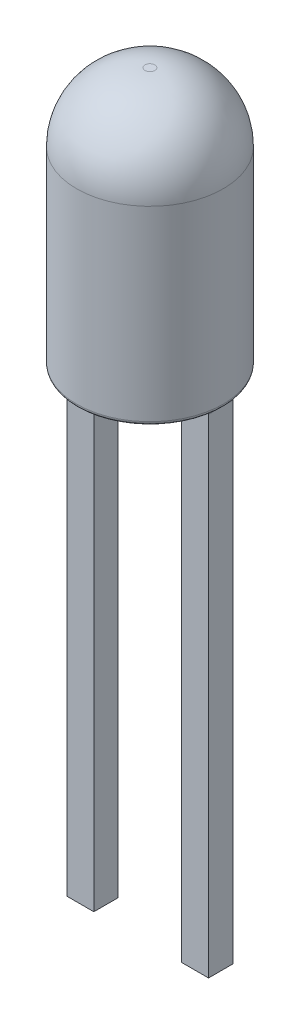
ISO-10303-21;
HEADER;
FILE_DESCRIPTION(('STEP AP214'),'2;1');
FILE_NAME('part.step','',(''),(''),'','','');
FILE_SCHEMA(('AUTOMOTIVE_DESIGN { 1 0 10303 214 1 1 1 1 }'));
ENDSEC;
DATA;
#1=APPLICATION_CONTEXT('core data for automotive mechanical design processes');
#2=APPLICATION_PROTOCOL_DEFINITION('international standard','automotive_design',2000,#1);
#3=PRODUCT_CONTEXT('',#1,'mechanical');
#4=PRODUCT('Part','Part','',(#3));
#5=PRODUCT_RELATED_PRODUCT_CATEGORY('part','',(#4));
#6=PRODUCT_DEFINITION_FORMATION('','',#4);
#7=PRODUCT_DEFINITION_CONTEXT('part definition',#1,'design');
#8=PRODUCT_DEFINITION('design','',#6,#7);
#9=PRODUCT_DEFINITION_SHAPE('','',#8);
#10=(LENGTH_UNIT() NAMED_UNIT(*) SI_UNIT(.MILLI.,.METRE.));
#11=(NAMED_UNIT(*) PLANE_ANGLE_UNIT() SI_UNIT($,.RADIAN.));
#12=(NAMED_UNIT(*) SI_UNIT($,.STERADIAN.) SOLID_ANGLE_UNIT());
#13=UNCERTAINTY_MEASURE_WITH_UNIT(LENGTH_MEASURE(1.E-05),#10,'distance_accuracy_value','');
#14=(GEOMETRIC_REPRESENTATION_CONTEXT(3) GLOBAL_UNCERTAINTY_ASSIGNED_CONTEXT((#13)) GLOBAL_UNIT_ASSIGNED_CONTEXT((#10,
#11,#12)) REPRESENTATION_CONTEXT('',''));
#15=CARTESIAN_POINT('',(0.,0.,0.));
#16=DIRECTION('',(0.,0.,1.));
#17=DIRECTION('',(1.,0.,0.));
#18=AXIS2_PLACEMENT_3D('',#15,#16,#17);
#19=CARTESIAN_POINT('',(0.,2.6,0.6));
#20=DIRECTION('',(0.,1.,0.));
#21=DIRECTION('',(0.,0.,1.));
#22=AXIS2_PLACEMENT_3D('',#19,#20,#21);
#23=PLANE('',#22);
#24=CARTESIAN_POINT('',(0.,2.6,0.));
#25=DIRECTION('',(0.,1.,0.));
#26=DIRECTION('',(0.,0.,1.));
#27=AXIS2_PLACEMENT_3D('',#24,#25,#26);
#28=CIRCLE('',#27,0.38819660112501);
#29=CARTESIAN_POINT('',(0.,2.6,0.38819660112501));
#30=VERTEX_POINT('',#29);
#31=EDGE_CURVE('E52',#30,#30,#28,.T.);
#32=ORIENTED_EDGE('',*,*,#31,.T.);
#33=EDGE_LOOP('',(#32));
#34=FACE_BOUND('',#33,.T.);
#35=ADVANCED_FACE('F45',(#34),#23,.T.);
#36=CARTESIAN_POINT('',(0.,2.6,0.));
#37=DIRECTION('',(0.,1.,0.));
#38=DIRECTION('',(0.,0.,1.));
#39=AXIS2_PLACEMENT_3D('',#36,#37,#38);
#40=CONICAL_SURFACE('',#39,0.6,1.10714871779409);
#41=CARTESIAN_POINT('',(0.,2.50527864045,0.));
#42=DIRECTION('',(0.,-1.,0.));
#43=DIRECTION('',(0.,0.,-1.));
#44=AXIS2_PLACEMENT_3D('',#41,#42,#43);
#45=CIRCLE('',#44,0.410557280900008);
#46=CARTESIAN_POINT('',(0.,2.50527864045,-0.410557280900008));
#47=VERTEX_POINT('',#46);
#48=EDGE_CURVE('E12',#47,#47,#45,.T.);
#49=ORIENTED_EDGE('',*,*,#48,.T.);
#50=EDGE_LOOP('',(#49));
#51=FACE_BOUND('',#50,.T.);
#52=CARTESIAN_POINT('',(0.,2.3,0.));
#53=VERTEX_POINT('',#52);
#54=VERTEX_LOOP('',#53);
#55=FACE_BOUND('',#54,.T.);
#56=ADVANCED_FACE('F55',(#51,#55),#40,.T.);
#57=CARTESIAN_POINT('',(0.,2.55,0.));
#58=DIRECTION('',(0.,1.,0.));
#59=DIRECTION('',(0.,0.,1.));
#60=AXIS2_PLACEMENT_3D('',#57,#58,#59);
#61=TOROIDAL_SURFACE('',#60,0.38819660112501,0.05);
#62=ORIENTED_EDGE('',*,*,#48,.F.);
#63=EDGE_LOOP('',(#62));
#64=FACE_BOUND('',#63,.T.);
#65=ORIENTED_EDGE('',*,*,#31,.F.);
#66=EDGE_LOOP('',(#65));
#67=FACE_BOUND('',#66,.T.);
#68=ADVANCED_FACE('F47',(#64,#67),#61,.T.);
#69=CLOSED_SHELL('',(#35,#56,#68));
#70=MANIFOLD_SOLID_BREP('B2',#69);
#71=CARTESIAN_POINT('',(0.899999999999999,-10.,0.25));
#72=DIRECTION('',(1.,0.,0.));
#73=DIRECTION('',(0.,0.,-1.));
#74=AXIS2_PLACEMENT_3D('',#71,#72,#73);
#75=PLANE('',#74);
#76=DIRECTION('',(0.,0.,-1.));
#77=VECTOR('',#76,1.);
#78=CARTESIAN_POINT('',(0.899999999999999,0.,0.25));
#79=LINE('',#78,#77);
#80=CARTESIAN_POINT('',(0.899999999999999,0.,0.25));
#81=VERTEX_POINT('',#80);
#82=CARTESIAN_POINT('',(0.899999999999999,0.,-0.25));
#83=VERTEX_POINT('',#82);
#84=EDGE_CURVE('E160',#81,#83,#79,.T.);
#85=ORIENTED_EDGE('',*,*,#84,.T.);
#86=DIRECTION('',(0.,1.,0.));
#87=VECTOR('',#86,1.);
#88=CARTESIAN_POINT('',(0.899999999999999,-10.,-0.25));
#89=LINE('',#88,#87);
#90=CARTESIAN_POINT('',(0.899999999999999,-10.,-0.25));
#91=VERTEX_POINT('',#90);
#92=EDGE_CURVE('E43',#91,#83,#89,.T.);
#93=ORIENTED_EDGE('',*,*,#92,.F.);
#94=DIRECTION('',(0.,0.,-1.));
#95=VECTOR('',#94,1.);
#96=CARTESIAN_POINT('',(0.899999999999999,-10.,0.25));
#97=LINE('',#96,#95);
#98=CARTESIAN_POINT('',(0.899999999999999,-10.,0.25));
#99=VERTEX_POINT('',#98);
#100=EDGE_CURVE('E148',#99,#91,#97,.T.);
#101=ORIENTED_EDGE('',*,*,#100,.F.);
#102=DIRECTION('',(0.,1.,0.));
#103=VECTOR('',#102,1.);
#104=CARTESIAN_POINT('',(0.899999999999999,-10.,0.25));
#105=LINE('',#104,#103);
#106=EDGE_CURVE('E156',#99,#81,#105,.T.);
#107=ORIENTED_EDGE('',*,*,#106,.T.);
#108=EDGE_LOOP('',(#85,#93,#101,#107));
#109=FACE_BOUND('',#108,.T.);
#110=ADVANCED_FACE('F97',(#109),#75,.F.);
#111=CARTESIAN_POINT('',(0.899999999999999,-10.,-0.25));
#112=DIRECTION('',(0.,0.,1.));
#113=DIRECTION('',(1.,0.,0.));
#114=AXIS2_PLACEMENT_3D('',#111,#112,#113);
#115=PLANE('',#114);
#116=DIRECTION('',(1.,0.,0.));
#117=VECTOR('',#116,1.);
#118=CARTESIAN_POINT('',(0.899999999999999,0.,-0.25));
#119=LINE('',#118,#117);
#120=CARTESIAN_POINT('',(1.45,0.,-0.25));
#121=VERTEX_POINT('',#120);
#122=EDGE_CURVE('E152',#83,#121,#119,.T.);
#123=ORIENTED_EDGE('',*,*,#122,.T.);
#124=DIRECTION('',(0.,1.,0.));
#125=VECTOR('',#124,1.);
#126=CARTESIAN_POINT('',(1.45,-10.,-0.25));
#127=LINE('',#126,#125);
#128=CARTESIAN_POINT('',(1.45,-10.,-0.25));
#129=VERTEX_POINT('',#128);
#130=EDGE_CURVE('E105',#129,#121,#127,.T.);
#131=ORIENTED_EDGE('',*,*,#130,.F.);
#132=DIRECTION('',(1.,0.,0.));
#133=VECTOR('',#132,1.);
#134=CARTESIAN_POINT('',(0.899999999999999,-10.,-0.25));
#135=LINE('',#134,#133);
#136=EDGE_CURVE('E143',#91,#129,#135,.T.);
#137=ORIENTED_EDGE('',*,*,#136,.F.);
#138=ORIENTED_EDGE('',*,*,#92,.T.);
#139=EDGE_LOOP('',(#123,#131,#137,#138));
#140=FACE_BOUND('',#139,.T.);
#141=ADVANCED_FACE('F151',(#140),#115,.F.);
#142=CARTESIAN_POINT('',(1.45,-10.,0.25));
#143=DIRECTION('',(-1.,0.,0.));
#144=DIRECTION('',(0.,0.,1.));
#145=AXIS2_PLACEMENT_3D('',#142,#143,#144);
#146=PLANE('',#145);
#147=DIRECTION('',(0.,0.,1.));
#148=VECTOR('',#147,1.);
#149=CARTESIAN_POINT('',(1.45,0.,0.25));
#150=LINE('',#149,#148);
#151=CARTESIAN_POINT('',(1.45,0.,0.25));
#152=VERTEX_POINT('',#151);
#153=EDGE_CURVE('E130',#121,#152,#150,.T.);
#154=ORIENTED_EDGE('',*,*,#153,.T.);
#155=DIRECTION('',(0.,1.,0.));
#156=VECTOR('',#155,1.);
#157=CARTESIAN_POINT('',(1.45,-10.,0.25));
#158=LINE('',#157,#156);
#159=CARTESIAN_POINT('',(1.45,-10.,0.25));
#160=VERTEX_POINT('',#159);
#161=EDGE_CURVE('E153',#160,#152,#158,.T.);
#162=ORIENTED_EDGE('',*,*,#161,.F.);
#163=DIRECTION('',(0.,0.,1.));
#164=VECTOR('',#163,1.);
#165=CARTESIAN_POINT('',(1.45,-10.,0.25));
#166=LINE('',#165,#164);
#167=EDGE_CURVE('E146',#129,#160,#166,.T.);
#168=ORIENTED_EDGE('',*,*,#167,.F.);
#169=ORIENTED_EDGE('',*,*,#130,.T.);
#170=EDGE_LOOP('',(#154,#162,#168,#169));
#171=FACE_BOUND('',#170,.T.);
#172=ADVANCED_FACE('F154',(#171),#146,.F.);
#173=CARTESIAN_POINT('',(0.899999999999999,-10.,0.25));
#174=DIRECTION('',(0.,0.,-1.));
#175=DIRECTION('',(-1.,0.,0.));
#176=AXIS2_PLACEMENT_3D('',#173,#174,#175);
#177=PLANE('',#176);
#178=DIRECTION('',(-1.,0.,0.));
#179=VECTOR('',#178,1.);
#180=CARTESIAN_POINT('',(0.899999999999999,0.,0.25));
#181=LINE('',#180,#179);
#182=EDGE_CURVE('E136',#152,#81,#181,.T.);
#183=ORIENTED_EDGE('',*,*,#182,.T.);
#184=ORIENTED_EDGE('',*,*,#106,.F.);
#185=DIRECTION('',(-1.,0.,0.));
#186=VECTOR('',#185,1.);
#187=CARTESIAN_POINT('',(0.899999999999999,-10.,0.25));
#188=LINE('',#187,#186);
#189=EDGE_CURVE('E113',#160,#99,#188,.T.);
#190=ORIENTED_EDGE('',*,*,#189,.F.);
#191=ORIENTED_EDGE('',*,*,#161,.T.);
#192=EDGE_LOOP('',(#183,#184,#190,#191));
#193=FACE_BOUND('',#192,.T.);
#194=ADVANCED_FACE('F167',(#193),#177,.F.);
#195=CARTESIAN_POINT('',(0.,-10.,0.));
#196=DIRECTION('',(0.,-1.,0.));
#197=DIRECTION('',(0.,0.,-1.));
#198=AXIS2_PLACEMENT_3D('',#195,#196,#197);
#199=PLANE('',#198);
#200=ORIENTED_EDGE('',*,*,#100,.T.);
#201=ORIENTED_EDGE('',*,*,#136,.T.);
#202=ORIENTED_EDGE('',*,*,#167,.T.);
#203=ORIENTED_EDGE('',*,*,#189,.T.);
#204=EDGE_LOOP('',(#200,#201,#202,#203));
#205=FACE_BOUND('',#204,.T.);
#206=ADVANCED_FACE('F144',(#205),#199,.T.);
#207=CARTESIAN_POINT('',(0.,0.,0.));
#208=DIRECTION('',(0.,-1.,0.));
#209=DIRECTION('',(0.,0.,-1.));
#210=AXIS2_PLACEMENT_3D('',#207,#208,#209);
#211=PLANE('',#210);
#212=ORIENTED_EDGE('',*,*,#84,.F.);
#213=ORIENTED_EDGE('',*,*,#182,.F.);
#214=ORIENTED_EDGE('',*,*,#153,.F.);
#215=ORIENTED_EDGE('',*,*,#122,.F.);
#216=EDGE_LOOP('',(#212,#213,#214,#215));
#217=FACE_BOUND('',#216,.T.);
#218=ADVANCED_FACE('F170',(#217),#211,.F.);
#219=CLOSED_SHELL('',(#110,#141,#172,#194,#206,#218));
#220=MANIFOLD_SOLID_BREP('B6',#219);
#221=CARTESIAN_POINT('',(-1.45,-10.,0.25));
#222=DIRECTION('',(1.,0.,0.));
#223=DIRECTION('',(0.,0.,-1.));
#224=AXIS2_PLACEMENT_3D('',#221,#222,#223);
#225=PLANE('',#224);
#226=DIRECTION('',(0.,0.,-1.));
#227=VECTOR('',#226,1.);
#228=CARTESIAN_POINT('',(-1.45,0.,0.25));
#229=LINE('',#228,#227);
#230=CARTESIAN_POINT('',(-1.45,0.,0.25));
#231=VERTEX_POINT('',#230);
#232=CARTESIAN_POINT('',(-1.45,0.,-0.25));
#233=VERTEX_POINT('',#232);
#234=EDGE_CURVE('E293',#231,#233,#229,.T.);
#235=ORIENTED_EDGE('',*,*,#234,.T.);
#236=DIRECTION('',(0.,1.,0.));
#237=VECTOR('',#236,1.);
#238=CARTESIAN_POINT('',(-1.45,-10.,-0.25));
#239=LINE('',#238,#237);
#240=CARTESIAN_POINT('',(-1.45,-10.,-0.25));
#241=VERTEX_POINT('',#240);
#242=EDGE_CURVE('E95',#241,#233,#239,.T.);
#243=ORIENTED_EDGE('',*,*,#242,.F.);
#244=DIRECTION('',(0.,0.,-1.));
#245=VECTOR('',#244,1.);
#246=CARTESIAN_POINT('',(-1.45,-10.,0.25));
#247=LINE('',#246,#245);
#248=CARTESIAN_POINT('',(-1.45,-10.,0.25));
#249=VERTEX_POINT('',#248);
#250=EDGE_CURVE('E281',#249,#241,#247,.T.);
#251=ORIENTED_EDGE('',*,*,#250,.F.);
#252=DIRECTION('',(0.,1.,0.));
#253=VECTOR('',#252,1.);
#254=CARTESIAN_POINT('',(-1.45,-10.,0.25));
#255=LINE('',#254,#253);
#256=EDGE_CURVE('E289',#249,#231,#255,.T.);
#257=ORIENTED_EDGE('',*,*,#256,.T.);
#258=EDGE_LOOP('',(#235,#243,#251,#257));
#259=FACE_BOUND('',#258,.T.);
#260=ADVANCED_FACE('F230',(#259),#225,.F.);
#261=CARTESIAN_POINT('',(-1.45,-10.,-0.25));
#262=DIRECTION('',(0.,0.,1.));
#263=DIRECTION('',(1.,0.,0.));
#264=AXIS2_PLACEMENT_3D('',#261,#262,#263);
#265=PLANE('',#264);
#266=DIRECTION('',(1.,0.,0.));
#267=VECTOR('',#266,1.);
#268=CARTESIAN_POINT('',(-1.45,0.,-0.25));
#269=LINE('',#268,#267);
#270=CARTESIAN_POINT('',(-0.9,0.,-0.25));
#271=VERTEX_POINT('',#270);
#272=EDGE_CURVE('E285',#233,#271,#269,.T.);
#273=ORIENTED_EDGE('',*,*,#272,.T.);
#274=DIRECTION('',(0.,1.,0.));
#275=VECTOR('',#274,1.);
#276=CARTESIAN_POINT('',(-0.9,-10.,-0.25));
#277=LINE('',#276,#275);
#278=CARTESIAN_POINT('',(-0.9,-10.,-0.25));
#279=VERTEX_POINT('',#278);
#280=EDGE_CURVE('E238',#279,#271,#277,.T.);
#281=ORIENTED_EDGE('',*,*,#280,.F.);
#282=DIRECTION('',(1.,0.,0.));
#283=VECTOR('',#282,1.);
#284=CARTESIAN_POINT('',(-1.45,-10.,-0.25));
#285=LINE('',#284,#283);
#286=EDGE_CURVE('E276',#241,#279,#285,.T.);
#287=ORIENTED_EDGE('',*,*,#286,.F.);
#288=ORIENTED_EDGE('',*,*,#242,.T.);
#289=EDGE_LOOP('',(#273,#281,#287,#288));
#290=FACE_BOUND('',#289,.T.);
#291=ADVANCED_FACE('F284',(#290),#265,.F.);
#292=CARTESIAN_POINT('',(-0.9,-10.,0.25));
#293=DIRECTION('',(-1.,0.,0.));
#294=DIRECTION('',(0.,0.,1.));
#295=AXIS2_PLACEMENT_3D('',#292,#293,#294);
#296=PLANE('',#295);
#297=DIRECTION('',(0.,0.,1.));
#298=VECTOR('',#297,1.);
#299=CARTESIAN_POINT('',(-0.9,0.,0.25));
#300=LINE('',#299,#298);
#301=CARTESIAN_POINT('',(-0.9,0.,0.25));
#302=VERTEX_POINT('',#301);
#303=EDGE_CURVE('E263',#271,#302,#300,.T.);
#304=ORIENTED_EDGE('',*,*,#303,.T.);
#305=DIRECTION('',(0.,1.,0.));
#306=VECTOR('',#305,1.);
#307=CARTESIAN_POINT('',(-0.9,-10.,0.25));
#308=LINE('',#307,#306);
#309=CARTESIAN_POINT('',(-0.9,-10.,0.25));
#310=VERTEX_POINT('',#309);
#311=EDGE_CURVE('E286',#310,#302,#308,.T.);
#312=ORIENTED_EDGE('',*,*,#311,.F.);
#313=DIRECTION('',(0.,0.,1.));
#314=VECTOR('',#313,1.);
#315=CARTESIAN_POINT('',(-0.9,-10.,0.25));
#316=LINE('',#315,#314);
#317=EDGE_CURVE('E279',#279,#310,#316,.T.);
#318=ORIENTED_EDGE('',*,*,#317,.F.);
#319=ORIENTED_EDGE('',*,*,#280,.T.);
#320=EDGE_LOOP('',(#304,#312,#318,#319));
#321=FACE_BOUND('',#320,.T.);
#322=ADVANCED_FACE('F287',(#321),#296,.F.);
#323=CARTESIAN_POINT('',(-1.45,-10.,0.25));
#324=DIRECTION('',(0.,0.,-1.));
#325=DIRECTION('',(-1.,0.,0.));
#326=AXIS2_PLACEMENT_3D('',#323,#324,#325);
#327=PLANE('',#326);
#328=DIRECTION('',(-1.,0.,0.));
#329=VECTOR('',#328,1.);
#330=CARTESIAN_POINT('',(-1.45,0.,0.25));
#331=LINE('',#330,#329);
#332=EDGE_CURVE('E269',#302,#231,#331,.T.);
#333=ORIENTED_EDGE('',*,*,#332,.T.);
#334=ORIENTED_EDGE('',*,*,#256,.F.);
#335=DIRECTION('',(-1.,0.,0.));
#336=VECTOR('',#335,1.);
#337=CARTESIAN_POINT('',(-1.45,-10.,0.25));
#338=LINE('',#337,#336);
#339=EDGE_CURVE('E246',#310,#249,#338,.T.);
#340=ORIENTED_EDGE('',*,*,#339,.F.);
#341=ORIENTED_EDGE('',*,*,#311,.T.);
#342=EDGE_LOOP('',(#333,#334,#340,#341));
#343=FACE_BOUND('',#342,.T.);
#344=ADVANCED_FACE('F300',(#343),#327,.F.);
#345=CARTESIAN_POINT('',(0.,-10.,0.));
#346=DIRECTION('',(0.,-1.,0.));
#347=DIRECTION('',(0.,0.,-1.));
#348=AXIS2_PLACEMENT_3D('',#345,#346,#347);
#349=PLANE('',#348);
#350=ORIENTED_EDGE('',*,*,#250,.T.);
#351=ORIENTED_EDGE('',*,*,#286,.T.);
#352=ORIENTED_EDGE('',*,*,#317,.T.);
#353=ORIENTED_EDGE('',*,*,#339,.T.);
#354=EDGE_LOOP('',(#350,#351,#352,#353));
#355=FACE_BOUND('',#354,.T.);
#356=ADVANCED_FACE('F277',(#355),#349,.T.);
#357=CARTESIAN_POINT('',(0.,0.,0.));
#358=DIRECTION('',(0.,-1.,0.));
#359=DIRECTION('',(0.,0.,-1.));
#360=AXIS2_PLACEMENT_3D('',#357,#358,#359);
#361=PLANE('',#360);
#362=ORIENTED_EDGE('',*,*,#234,.F.);
#363=ORIENTED_EDGE('',*,*,#332,.F.);
#364=ORIENTED_EDGE('',*,*,#303,.F.);
#365=ORIENTED_EDGE('',*,*,#272,.F.);
#366=EDGE_LOOP('',(#362,#363,#364,#365));
#367=FACE_BOUND('',#366,.T.);
#368=ADVANCED_FACE('F303',(#367),#361,.F.);
#369=CLOSED_SHELL('',(#260,#291,#322,#344,#356,#368));
#370=MANIFOLD_SOLID_BREP('B37',#369);
#371=CARTESIAN_POINT('',(1.45,2.6,-0.25));
#372=DIRECTION('',(0.,1.,0.));
#373=DIRECTION('',(-1.,0.,0.));
#374=AXIS2_PLACEMENT_3D('',#371,#372,#373);
#375=PLANE('',#374);
#376=CARTESIAN_POINT('',(0.,2.6,0.));
#377=DIRECTION('',(0.,1.,0.));
#378=DIRECTION('',(0.,0.,1.));
#379=AXIS2_PLACEMENT_3D('',#376,#377,#378);
#380=CIRCLE('',#379,0.6);
#381=CARTESIAN_POINT('',(0.545435605731786,2.6,0.25));
#382=VERTEX_POINT('',#381);
#383=CARTESIAN_POINT('',(0.545435605731786,2.6,-0.25));
#384=VERTEX_POINT('',#383);
#385=EDGE_CURVE('E469',#382,#384,#380,.T.);
#386=ORIENTED_EDGE('',*,*,#385,.F.);
#387=DIRECTION('',(-1.,0.,0.));
#388=VECTOR('',#387,1.);
#389=CARTESIAN_POINT('',(1.45,2.6,0.25));
#390=LINE('',#389,#388);
#391=CARTESIAN_POINT('',(1.45,2.6,0.25));
#392=VERTEX_POINT('',#391);
#393=EDGE_CURVE('E509',#392,#382,#390,.T.);
#394=ORIENTED_EDGE('',*,*,#393,.F.);
#395=DIRECTION('',(0.,0.,1.));
#396=VECTOR('',#395,1.);
#397=CARTESIAN_POINT('',(1.45,2.6,-0.25));
#398=LINE('',#397,#396);
#399=CARTESIAN_POINT('',(1.45,2.6,-0.25));
#400=VERTEX_POINT('',#399);
#401=EDGE_CURVE('E496',#400,#392,#398,.T.);
#402=ORIENTED_EDGE('',*,*,#401,.F.);
#403=DIRECTION('',(-1.,0.,0.));
#404=VECTOR('',#403,1.);
#405=CARTESIAN_POINT('',(1.45,2.6,-0.25));
#406=LINE('',#405,#404);
#407=EDGE_CURVE('E479',#400,#384,#406,.T.);
#408=ORIENTED_EDGE('',*,*,#407,.T.);
#409=EDGE_LOOP('',(#386,#394,#402,#408));
#410=FACE_BOUND('',#409,.T.);
#411=ADVANCED_FACE('F363',(#410),#375,.T.);
#412=CARTESIAN_POINT('',(1.45,0.,-0.25));
#413=DIRECTION('',(1.,0.,0.));
#414=DIRECTION('',(0.,1.,0.));
#415=AXIS2_PLACEMENT_3D('',#412,#413,#414);
#416=PLANE('',#415);
#417=ORIENTED_EDGE('',*,*,#401,.T.);
#418=DIRECTION('',(0.,1.,0.));
#419=VECTOR('',#418,1.);
#420=CARTESIAN_POINT('',(1.45,0.,0.25));
#421=LINE('',#420,#419);
#422=CARTESIAN_POINT('',(1.45,0.,0.25));
#423=VERTEX_POINT('',#422);
#424=EDGE_CURVE('E507',#423,#392,#421,.T.);
#425=ORIENTED_EDGE('',*,*,#424,.F.);
#426=DIRECTION('',(0.,0.,1.));
#427=VECTOR('',#426,1.);
#428=CARTESIAN_POINT('',(1.45,0.,-0.25));
#429=LINE('',#428,#427);
#430=CARTESIAN_POINT('',(1.45,0.,-0.25));
#431=VERTEX_POINT('',#430);
#432=EDGE_CURVE('E377',#431,#423,#429,.T.);
#433=ORIENTED_EDGE('',*,*,#432,.F.);
#434=DIRECTION('',(0.,1.,0.));
#435=VECTOR('',#434,1.);
#436=CARTESIAN_POINT('',(1.45,0.,-0.25));
#437=LINE('',#436,#435);
#438=EDGE_CURVE('E480',#431,#400,#437,.T.);
#439=ORIENTED_EDGE('',*,*,#438,.T.);
#440=EDGE_LOOP('',(#417,#425,#433,#439));
#441=FACE_BOUND('',#440,.T.);
#442=ADVANCED_FACE('F365',(#441),#416,.T.);
#443=CARTESIAN_POINT('',(0.899999999999999,0.,-0.25));
#444=DIRECTION('',(0.,-1.,0.));
#445=DIRECTION('',(1.,0.,0.));
#446=AXIS2_PLACEMENT_3D('',#443,#444,#445);
#447=PLANE('',#446);
#448=ORIENTED_EDGE('',*,*,#432,.T.);
#449=DIRECTION('',(1.,0.,0.));
#450=VECTOR('',#449,1.);
#451=CARTESIAN_POINT('',(0.899999999999999,0.,0.25));
#452=LINE('',#451,#450);
#453=CARTESIAN_POINT('',(0.899999999999999,0.,0.25));
#454=VERTEX_POINT('',#453);
#455=EDGE_CURVE('E482',#454,#423,#452,.T.);
#456=ORIENTED_EDGE('',*,*,#455,.F.);
#457=DIRECTION('',(0.,0.,1.));
#458=VECTOR('',#457,1.);
#459=CARTESIAN_POINT('',(0.899999999999999,0.,-0.25));
#460=LINE('',#459,#458);
#461=CARTESIAN_POINT('',(0.899999999999999,0.,-0.25));
#462=VERTEX_POINT('',#461);
#463=EDGE_CURVE('E498',#462,#454,#460,.T.);
#464=ORIENTED_EDGE('',*,*,#463,.F.);
#465=DIRECTION('',(1.,0.,0.));
#466=VECTOR('',#465,1.);
#467=CARTESIAN_POINT('',(0.899999999999999,0.,-0.25));
#468=LINE('',#467,#466);
#469=EDGE_CURVE('E493',#462,#431,#468,.T.);
#470=ORIENTED_EDGE('',*,*,#469,.T.);
#471=EDGE_LOOP('',(#448,#456,#464,#470));
#472=FACE_BOUND('',#471,.T.);
#473=ADVANCED_FACE('F449',(#472),#447,.T.);
#474=CARTESIAN_POINT('',(0.899999999999999,0.6,-0.25));
#475=DIRECTION('',(-1.,0.,0.));
#476=DIRECTION('',(0.,0.,1.));
#477=AXIS2_PLACEMENT_3D('',#474,#475,#476);
#478=PLANE('',#477);
#479=ORIENTED_EDGE('',*,*,#463,.T.);
#480=DIRECTION('',(0.,-1.,0.));
#481=VECTOR('',#480,1.);
#482=CARTESIAN_POINT('',(0.899999999999999,0.6,0.25));
#483=LINE('',#482,#481);
#484=CARTESIAN_POINT('',(0.899999999999999,0.6,0.25));
#485=VERTEX_POINT('',#484);
#486=EDGE_CURVE('E527',#485,#454,#483,.T.);
#487=ORIENTED_EDGE('',*,*,#486,.F.);
#488=DIRECTION('',(0.,0.,1.));
#489=VECTOR('',#488,1.);
#490=CARTESIAN_POINT('',(0.899999999999999,0.6,-0.25));
#491=LINE('',#490,#489);
#492=CARTESIAN_POINT('',(0.899999999999999,0.6,-0.25));
#493=VERTEX_POINT('',#492);
#494=EDGE_CURVE('E500',#493,#485,#491,.T.);
#495=ORIENTED_EDGE('',*,*,#494,.F.);
#496=DIRECTION('',(0.,-1.,0.));
#497=VECTOR('',#496,1.);
#498=CARTESIAN_POINT('',(0.899999999999999,0.6,-0.25));
#499=LINE('',#498,#497);
#500=EDGE_CURVE('E490',#493,#462,#499,.T.);
#501=ORIENTED_EDGE('',*,*,#500,.T.);
#502=EDGE_LOOP('',(#479,#487,#495,#501));
#503=FACE_BOUND('',#502,.T.);
#504=ADVANCED_FACE('F536',(#503),#478,.T.);
#505=CARTESIAN_POINT('',(0.496677265615149,0.6,-0.25));
#506=DIRECTION('',(0.,-1.,0.));
#507=DIRECTION('',(0.,0.,-1.));
#508=AXIS2_PLACEMENT_3D('',#505,#506,#507);
#509=PLANE('',#508);
#510=ORIENTED_EDGE('',*,*,#494,.T.);
#511=DIRECTION('',(1.,0.,0.));
#512=VECTOR('',#511,1.);
#513=CARTESIAN_POINT('',(0.496677265615149,0.6,0.25));
#514=LINE('',#513,#512);
#515=CARTESIAN_POINT('',(0.496677265615149,0.6,0.25));
#516=VERTEX_POINT('',#515);
#517=EDGE_CURVE('E524',#516,#485,#514,.T.);
#518=ORIENTED_EDGE('',*,*,#517,.F.);
#519=DIRECTION('',(0.,0.,1.));
#520=VECTOR('',#519,1.);
#521=CARTESIAN_POINT('',(0.496677265615149,0.6,-0.25));
#522=LINE('',#521,#520);
#523=CARTESIAN_POINT('',(0.496677265615149,0.6,-0.25));
#524=VERTEX_POINT('',#523);
#525=EDGE_CURVE('E502',#524,#516,#522,.T.);
#526=ORIENTED_EDGE('',*,*,#525,.F.);
#527=DIRECTION('',(1.,0.,0.));
#528=VECTOR('',#527,1.);
#529=CARTESIAN_POINT('',(0.496677265615149,0.6,-0.25));
#530=LINE('',#529,#528);
#531=EDGE_CURVE('E487',#524,#493,#530,.T.);
#532=ORIENTED_EDGE('',*,*,#531,.T.);
#533=EDGE_LOOP('',(#510,#518,#526,#532));
#534=FACE_BOUND('',#533,.T.);
#535=ADVANCED_FACE('F461',(#534),#509,.T.);
#536=CARTESIAN_POINT('',(-0.872452828416084,2.6,-0.25));
#537=DIRECTION('',(-0.825170902439274,-0.56488315762426,0.));
#538=DIRECTION('',(0.56488315762426,-0.825170902439274,0.));
#539=AXIS2_PLACEMENT_3D('',#536,#537,#538);
#540=PLANE('',#539);
#541=ORIENTED_EDGE('',*,*,#525,.T.);
#542=DIRECTION('',(0.56488315762426,-0.825170902439274,0.));
#543=VECTOR('',#542,1.);
#544=CARTESIAN_POINT('',(-0.872452828416084,2.6,0.25));
#545=LINE('',#544,#543);
#546=CARTESIAN_POINT('',(-0.872452828416084,2.6,0.25));
#547=VERTEX_POINT('',#546);
#548=EDGE_CURVE('E510',#547,#516,#545,.T.);
#549=ORIENTED_EDGE('',*,*,#548,.F.);
#550=DIRECTION('',(0.,0.,1.));
#551=VECTOR('',#550,1.);
#552=CARTESIAN_POINT('',(-0.872452828416084,2.6,-0.25));
#553=LINE('',#552,#551);
#554=CARTESIAN_POINT('',(-0.872452828416084,2.6,-0.25));
#555=VERTEX_POINT('',#554);
#556=EDGE_CURVE('E504',#555,#547,#553,.T.);
#557=ORIENTED_EDGE('',*,*,#556,.F.);
#558=DIRECTION('',(0.56488315762426,-0.825170902439274,0.));
#559=VECTOR('',#558,1.);
#560=CARTESIAN_POINT('',(-0.872452828416084,2.6,-0.25));
#561=LINE('',#560,#559);
#562=EDGE_CURVE('E478',#555,#524,#561,.T.);
#563=ORIENTED_EDGE('',*,*,#562,.T.);
#564=EDGE_LOOP('',(#541,#549,#557,#563));
#565=FACE_BOUND('',#564,.T.);
#566=ADVANCED_FACE('F453',(#565),#540,.T.);
#567=CARTESIAN_POINT('',(-0.545435605731786,2.6,-0.25));
#568=VERTEX_POINT('',#567);
#569=CARTESIAN_POINT('',(-0.545435605731785,2.6,0.25));
#570=VERTEX_POINT('',#569);
#571=EDGE_CURVE('E383',#568,#570,#380,.T.);
#572=ORIENTED_EDGE('',*,*,#571,.F.);
#573=EDGE_CURVE('E466',#568,#555,#406,.T.);
#574=ORIENTED_EDGE('',*,*,#573,.T.);
#575=ORIENTED_EDGE('',*,*,#556,.T.);
#576=EDGE_CURVE('E468',#570,#547,#390,.T.);
#577=ORIENTED_EDGE('',*,*,#576,.F.);
#578=EDGE_LOOP('',(#572,#574,#575,#577));
#579=FACE_BOUND('',#578,.T.);
#580=ADVANCED_FACE('F445',(#579),#375,.T.);
#581=CARTESIAN_POINT('',(0.,0.,-0.25));
#582=DIRECTION('',(0.,0.,1.));
#583=DIRECTION('',(1.,0.,0.));
#584=AXIS2_PLACEMENT_3D('',#581,#582,#583);
#585=PLANE('',#584);
#586=ORIENTED_EDGE('',*,*,#573,.F.);
#587=CARTESIAN_POINT('',(-3.13127537656696,3.87061974104925,-0.25));
#588=CARTESIAN_POINT('',(-3.02616927307059,3.8182346186147,-0.25));
#589=CARTESIAN_POINT('',(-2.92105741582946,3.7658610255892,-0.25));
#590=CARTESIAN_POINT('',(-2.71081233694347,3.66114962666983,-0.25));
#591=CARTESIAN_POINT('',(-2.60567911479844,3.60881182178027,-0.25));
#592=CARTESIAN_POINT('',(-2.3953118068819,3.50415008599049,-0.25));
#593=CARTESIAN_POINT('',(-2.29007770280435,3.45182619188242,-0.25));
#594=CARTESIAN_POINT('',(-2.07957417373004,3.34725643060662,-0.25));
#595=CARTESIAN_POINT('',(-1.97430474973773,3.29501056141794,-0.25));
#596=CARTESIAN_POINT('',(-1.75541434097141,3.18653158056599,-0.25));
#597=CARTESIAN_POINT('',(-1.64178841835444,3.1303084345577,-0.25));
#598=CARTESIAN_POINT('',(-1.41440575519692,3.0181038832042,-0.25));
#599=CARTESIAN_POINT('',(-1.30064900499206,2.96212249739363,-0.25));
#600=CARTESIAN_POINT('',(-1.12984958154925,2.87856020625857,-0.25));
#601=CARTESIAN_POINT('',(-1.07290372371398,2.85078149857994,-0.25));
#602=CARTESIAN_POINT('',(-0.958908116191299,2.79543302919637,-0.25));
#603=CARTESIAN_POINT('',(-0.901858363392625,2.76786327388077,-0.25));
#604=CARTESIAN_POINT('',(-0.787597489658005,2.71308239399503,-0.25));
#605=CARTESIAN_POINT('',(-0.730386394104289,2.68587121645993,-0.25));
#606=CARTESIAN_POINT('',(-0.615665813192752,2.63208709470701,-0.25));
#607=CARTESIAN_POINT('',(-0.558156347618948,2.60551410881402,-0.25));
#608=CARTESIAN_POINT('',(-0.472736629229629,2.56731724814406,-0.25));
#609=CARTESIAN_POINT('',(-0.445074270844971,2.55514253554936,-0.25));
#610=CARTESIAN_POINT('',(-0.389517912529428,2.53130995669681,-0.25));
#611=CARTESIAN_POINT('',(-0.361623848485328,2.51965223955967,-0.25));
#612=CARTESIAN_POINT('',(-0.305624512563111,2.49724713933581,-0.25));
#613=CARTESIAN_POINT('',(-0.277520993954366,2.48649549621836,-0.25));
#614=CARTESIAN_POINT('',(-0.220804574219466,2.46646638968723,-0.25));
#615=CARTESIAN_POINT('',(-0.192191817889895,2.45718851444077,-0.25));
#616=CARTESIAN_POINT('',(-0.127323229838108,2.43948615162866,-0.25));
#617=CARTESIAN_POINT('',(-0.0908434107024148,2.43176735981997,-0.25));
#618=CARTESIAN_POINT('',(-0.0356200665261287,2.425944855828,-0.25));
#619=CARTESIAN_POINT('',(-0.0171980129398181,2.42495640925329,-0.25));
#620=CARTESIAN_POINT('',(0.0196409521041017,2.42504657470959,-0.25));
#621=CARTESIAN_POINT('',(0.0380578632411665,2.42612529520745,-0.25));
#622=CARTESIAN_POINT('',(0.0813484679575112,2.43088384266615,-0.25));
#623=CARTESIAN_POINT('',(0.106129891946347,2.43536816502978,-0.25));
#624=CARTESIAN_POINT('',(0.155150514949598,2.44670781127253,-0.25));
#625=CARTESIAN_POINT('',(0.179388583992442,2.45356766187756,-0.25));
#626=CARTESIAN_POINT('',(0.228145664538789,2.46895517480587,-0.25));
#627=CARTESIAN_POINT('',(0.252649984712551,2.47752805631762,-0.25));
#628=CARTESIAN_POINT('',(0.301288792937497,2.49558324259204,-0.25));
#629=CARTESIAN_POINT('',(0.32542359884299,2.50506470813029,-0.25));
#630=CARTESIAN_POINT('',(0.380124314779341,2.52730732009407,-0.25));
#631=CARTESIAN_POINT('',(0.410616415069829,2.54024847141458,-0.25));
#632=CARTESIAN_POINT('',(0.471364371732484,2.5666761060369,-0.25));
#633=CARTESIAN_POINT('',(0.501620204419359,2.58016264319592,-0.25));
#634=CARTESIAN_POINT('',(0.592176594469759,2.62113024332584,-0.25));
#635=CARTESIAN_POINT('',(0.652249654368261,2.6491123130671,-0.25));
#636=CARTESIAN_POINT('',(0.772179906180579,2.70570548235934,-0.25));
#637=CARTESIAN_POINT('',(0.83203676956275,2.73431726962234,-0.25));
#638=CARTESIAN_POINT('',(0.951580342097104,2.79186980664737,-0.25));
#639=CARTESIAN_POINT('',(1.01126707725493,2.8208105023407,-0.25));
#640=CARTESIAN_POINT('',(1.12077371797258,2.87413150490493,-0.25));
#641=CARTESIAN_POINT('',(1.17060810312261,2.89848216672055,-0.25));
#642=CARTESIAN_POINT('',(1.27023232358981,2.94728085133593,-0.25));
#643=CARTESIAN_POINT('',(1.32002215652447,2.97172887900112,-0.25));
#644=CARTESIAN_POINT('',(1.41948449422676,3.02065187798308,-0.25));
#645=CARTESIAN_POINT('',(1.46915705541582,3.04512673467725,-0.25));
#646=CARTESIAN_POINT('',(1.56847416177759,3.09412660797166,-0.25));
#647=CARTESIAN_POINT('',(1.61811870829549,3.118651621845,-0.25));
#648=CARTESIAN_POINT('',(1.66775458850937,3.14319413059717,-0.25));
#649=B_SPLINE_CURVE_WITH_KNOTS('',3,(#587,#588,#589,#590,#591,#592,#593,#594,#595,#596,#597,
#598,#599,#600,#601,#602,#603,#604,#605,#606,#607,#608,#609,#610,#611,#612,#613,#614,#615,#616,
#617,#618,#619,#620,#621,#622,#623,#624,#625,#626,#627,#628,#629,#630,#631,#632,#633,#634,#635,
#636,#637,#638,#639,#640,#641,#642,#643,#644,#645,#646,#647,#648),.UNSPECIFIED.,.F.,.F.,(4,2,2,
2,2,2,2,2,2,2,2,2,2,2,2,2,2,2,2,2,2,2,2,2,2,2,2,2,2,2,4),(0.,0.352311585750469,
0.704632682739051,1.05720614901329,1.40977031902344,1.79009517446912,2.17045020643485,
2.36052997880556,2.55061554016961,2.74067270226194,2.93071741931624,3.02138258308969,
3.11207373020586,3.20231144404898,3.2925238971469,3.40381102939306,3.45904392611075,
3.51427972104754,3.58964017282537,3.6651450264083,3.74299717820509,3.82077810162007,
3.92014222864358,4.01951619201495,4.2183175476844,4.41734799463508,4.61634618341529,
4.7827425999366,4.94914743842179,5.1152721754272,5.28138810881543),.UNSPECIFIED.);
#650=EDGE_CURVE('E474',#568,#384,#649,.T.);
#651=ORIENTED_EDGE('',*,*,#650,.T.);
#652=ORIENTED_EDGE('',*,*,#407,.F.);
#653=ORIENTED_EDGE('',*,*,#438,.F.);
#654=ORIENTED_EDGE('',*,*,#469,.F.);
#655=ORIENTED_EDGE('',*,*,#500,.F.);
#656=ORIENTED_EDGE('',*,*,#531,.F.);
#657=ORIENTED_EDGE('',*,*,#562,.F.);
#658=EDGE_LOOP('',(#586,#651,#652,#653,#654,#655,#656,#657));
#659=FACE_BOUND('',#658,.T.);
#660=ADVANCED_FACE('F440',(#659),#585,.F.);
#661=CARTESIAN_POINT('',(0.,0.,0.25));
#662=DIRECTION('',(0.,0.,1.));
#663=DIRECTION('',(1.,0.,0.));
#664=AXIS2_PLACEMENT_3D('',#661,#662,#663);
#665=PLANE('',#664);
#666=CARTESIAN_POINT('',(-3.13127537656696,3.87061974104926,0.25));
#667=CARTESIAN_POINT('',(-3.02616927307059,3.81823461861471,0.25));
#668=CARTESIAN_POINT('',(-2.92105741582946,3.7658610255892,0.25));
#669=CARTESIAN_POINT('',(-2.71081233694347,3.66114962666983,0.25));
#670=CARTESIAN_POINT('',(-2.60567911479844,3.60881182178027,0.25));
#671=CARTESIAN_POINT('',(-2.39531180688189,3.50415008599049,0.25));
#672=CARTESIAN_POINT('',(-2.29007770280435,3.45182619188242,0.25));
#673=CARTESIAN_POINT('',(-2.07957417373004,3.34725643060662,0.25));
#674=CARTESIAN_POINT('',(-1.97430474973773,3.29501056141794,0.25));
#675=CARTESIAN_POINT('',(-1.7554143409714,3.18653158056598,0.25));
#676=CARTESIAN_POINT('',(-1.64178841835444,3.1303084345577,0.25));
#677=CARTESIAN_POINT('',(-1.41440575519692,3.0181038832042,0.25));
#678=CARTESIAN_POINT('',(-1.30064900499206,2.96212249739363,0.25));
#679=CARTESIAN_POINT('',(-1.12984958154925,2.87856020625857,0.25));
#680=CARTESIAN_POINT('',(-1.07290372371397,2.85078149857994,0.25));
#681=CARTESIAN_POINT('',(-0.958908116191298,2.79543302919637,0.25));
#682=CARTESIAN_POINT('',(-0.901858363392623,2.76786327388077,0.25));
#683=CARTESIAN_POINT('',(-0.787597489658004,2.71308239399503,0.25));
#684=CARTESIAN_POINT('',(-0.730386394104289,2.68587121645993,0.25));
#685=CARTESIAN_POINT('',(-0.615665813192752,2.63208709470701,0.25));
#686=CARTESIAN_POINT('',(-0.558156347618949,2.60551410881402,0.25));
#687=CARTESIAN_POINT('',(-0.47273662922963,2.56731724814406,0.25));
#688=CARTESIAN_POINT('',(-0.445074270844971,2.55514253554936,0.25));
#689=CARTESIAN_POINT('',(-0.389517912529428,2.53130995669681,0.25));
#690=CARTESIAN_POINT('',(-0.361623848485328,2.51965223955967,0.25));
#691=CARTESIAN_POINT('',(-0.305624512563111,2.49724713933581,0.25));
#692=CARTESIAN_POINT('',(-0.277520993954366,2.48649549621836,0.25));
#693=CARTESIAN_POINT('',(-0.220804574219467,2.46646638968723,0.25));
#694=CARTESIAN_POINT('',(-0.192191817889895,2.45718851444077,0.25));
#695=CARTESIAN_POINT('',(-0.127323229838109,2.43948615162866,0.25));
#696=CARTESIAN_POINT('',(-0.0908434107024155,2.43176735981997,0.25));
#697=CARTESIAN_POINT('',(-0.0356200665261294,2.425944855828,0.25));
#698=CARTESIAN_POINT('',(-0.0171980129398188,2.42495640925329,0.25));
#699=CARTESIAN_POINT('',(0.019640952104101,2.42504657470959,0.25));
#700=CARTESIAN_POINT('',(0.0380578632411658,2.42612529520745,0.25));
#701=CARTESIAN_POINT('',(0.0813484679575104,2.43088384266615,0.25));
#702=CARTESIAN_POINT('',(0.106129891946346,2.43536816502978,0.25));
#703=CARTESIAN_POINT('',(0.155150514949597,2.44670781127253,0.25));
#704=CARTESIAN_POINT('',(0.179388583992441,2.45356766187756,0.25));
#705=CARTESIAN_POINT('',(0.228145664538788,2.46895517480587,0.25));
#706=CARTESIAN_POINT('',(0.25264998471255,2.47752805631762,0.25));
#707=CARTESIAN_POINT('',(0.301288792937496,2.49558324259204,0.25));
#708=CARTESIAN_POINT('',(0.325423598842989,2.50506470813029,0.25));
#709=CARTESIAN_POINT('',(0.380124314779339,2.52730732009407,0.25));
#710=CARTESIAN_POINT('',(0.410616415069827,2.54024847141458,0.25));
#711=CARTESIAN_POINT('',(0.471364371732482,2.5666761060369,0.25));
#712=CARTESIAN_POINT('',(0.501620204419356,2.58016264319591,0.25));
#713=CARTESIAN_POINT('',(0.592176594469756,2.62113024332583,0.25));
#714=CARTESIAN_POINT('',(0.652249654368258,2.6491123130671,0.25));
#715=CARTESIAN_POINT('',(0.772179906180575,2.70570548235934,0.25));
#716=CARTESIAN_POINT('',(0.832036769562745,2.73431726962234,0.25));
#717=CARTESIAN_POINT('',(0.951580342097098,2.79186980664737,0.25));
#718=CARTESIAN_POINT('',(1.01126707725492,2.82081050234069,0.25));
#719=CARTESIAN_POINT('',(1.12077371797257,2.87413150490493,0.25));
#720=CARTESIAN_POINT('',(1.17060810312261,2.89848216672055,0.25));
#721=CARTESIAN_POINT('',(1.2702323235898,2.94728085133593,0.25));
#722=CARTESIAN_POINT('',(1.32002215652446,2.97172887900112,0.25));
#723=CARTESIAN_POINT('',(1.41948449422675,3.02065187798307,0.25));
#724=CARTESIAN_POINT('',(1.46915705541581,3.04512673467725,0.25));
#725=CARTESIAN_POINT('',(1.56847416177758,3.09412660797166,0.25));
#726=CARTESIAN_POINT('',(1.61811870829548,3.11865162184499,0.25));
#727=CARTESIAN_POINT('',(1.66775458850936,3.14319413059716,0.25));
#728=B_SPLINE_CURVE_WITH_KNOTS('',3,(#666,#667,#668,#669,#670,#671,#672,#673,#674,#675,#676,
#677,#678,#679,#680,#681,#682,#683,#684,#685,#686,#687,#688,#689,#690,#691,#692,#693,#694,#695,
#696,#697,#698,#699,#700,#701,#702,#703,#704,#705,#706,#707,#708,#709,#710,#711,#712,#713,#714,
#715,#716,#717,#718,#719,#720,#721,#722,#723,#724,#725,#726,#727),.UNSPECIFIED.,.F.,.F.,(4,2,2,
2,2,2,2,2,2,2,2,2,2,2,2,2,2,2,2,2,2,2,2,2,2,2,2,2,2,2,4),(0.,0.352311585750469,
0.704632682739052,1.05720614901329,1.40977031902345,1.79009517446912,2.17045020643486,
2.36052997880556,2.55061554016961,2.74067270226194,2.93071741931624,3.02138258308969,
3.11207373020586,3.20231144404898,3.2925238971469,3.40381102939306,3.45904392611075,
3.51427972104754,3.58964017282537,3.6651450264083,3.74299717820509,3.82077810162006,
3.92014222864358,4.01951619201494,4.2183175476844,4.41734799463508,4.61634618341528,
4.78274259993659,4.94914743842178,5.11527217542719,5.28138810881542),.UNSPECIFIED.);
#729=EDGE_CURVE('E228',#570,#382,#728,.T.);
#730=ORIENTED_EDGE('',*,*,#729,.F.);
#731=ORIENTED_EDGE('',*,*,#576,.T.);
#732=ORIENTED_EDGE('',*,*,#548,.T.);
#733=ORIENTED_EDGE('',*,*,#517,.T.);
#734=ORIENTED_EDGE('',*,*,#486,.T.);
#735=ORIENTED_EDGE('',*,*,#455,.T.);
#736=ORIENTED_EDGE('',*,*,#424,.T.);
#737=ORIENTED_EDGE('',*,*,#393,.T.);
#738=EDGE_LOOP('',(#730,#731,#732,#733,#734,#735,#736,#737));
#739=FACE_BOUND('',#738,.T.);
#740=ADVANCED_FACE('F436',(#739),#665,.T.);
#741=CARTESIAN_POINT('',(0.,2.6,0.));
#742=DIRECTION('',(0.,1.,0.));
#743=DIRECTION('',(0.,0.,1.));
#744=AXIS2_PLACEMENT_3D('',#741,#742,#743);
#745=CONICAL_SURFACE('',#744,0.6,1.10714871779409);
#746=CARTESIAN_POINT('',(0.,2.3,0.));
#747=VERTEX_POINT('',#746);
#748=VERTEX_LOOP('',#747);
#749=FACE_BOUND('',#748,.T.);
#750=ORIENTED_EDGE('',*,*,#571,.T.);
#751=ORIENTED_EDGE('',*,*,#729,.T.);
#752=ORIENTED_EDGE('',*,*,#385,.T.);
#753=ORIENTED_EDGE('',*,*,#650,.F.);
#754=EDGE_LOOP('',(#750,#751,#752,#753));
#755=FACE_BOUND('',#754,.T.);
#756=ADVANCED_FACE('F434',(#749,#755),#745,.F.);
#757=CLOSED_SHELL('',(#411,#442,#473,#504,#535,#566,#580,#660,#740,#756));
#758=MANIFOLD_SOLID_BREP('B89',#757);
#759=CARTESIAN_POINT('',(-0.9,0.,-0.25));
#760=DIRECTION('',(1.,0.,0.));
#761=DIRECTION('',(0.,0.,-1.));
#762=AXIS2_PLACEMENT_3D('',#759,#760,#761);
#763=PLANE('',#762);
#764=DIRECTION('',(0.,0.,1.));
#765=VECTOR('',#764,1.);
#766=CARTESIAN_POINT('',(-0.9,0.6,-0.25));
#767=LINE('',#766,#765);
#768=CARTESIAN_POINT('',(-0.9,0.6,-0.25));
#769=VERTEX_POINT('',#768);
#770=CARTESIAN_POINT('',(-0.9,0.6,0.25));
#771=VERTEX_POINT('',#770);
#772=EDGE_CURVE('E612',#769,#771,#767,.T.);
#773=ORIENTED_EDGE('',*,*,#772,.T.);
#774=DIRECTION('',(0.,1.,0.));
#775=VECTOR('',#774,1.);
#776=CARTESIAN_POINT('',(-0.9,0.,0.25));
#777=LINE('',#776,#775);
#778=CARTESIAN_POINT('',(-0.9,0.,0.25));
#779=VERTEX_POINT('',#778);
#780=EDGE_CURVE('E667',#779,#771,#777,.T.);
#781=ORIENTED_EDGE('',*,*,#780,.F.);
#782=DIRECTION('',(0.,0.,1.));
#783=VECTOR('',#782,1.);
#784=CARTESIAN_POINT('',(-0.9,0.,-0.25));
#785=LINE('',#784,#783);
#786=CARTESIAN_POINT('',(-0.9,0.,-0.25));
#787=VERTEX_POINT('',#786);
#788=EDGE_CURVE('E361',#787,#779,#785,.T.);
#789=ORIENTED_EDGE('',*,*,#788,.F.);
#790=DIRECTION('',(0.,1.,0.));
#791=VECTOR('',#790,1.);
#792=CARTESIAN_POINT('',(-0.9,0.,-0.25));
#793=LINE('',#792,#791);
#794=EDGE_CURVE('E668',#787,#769,#793,.T.);
#795=ORIENTED_EDGE('',*,*,#794,.T.);
#796=EDGE_LOOP('',(#773,#781,#789,#795));
#797=FACE_BOUND('',#796,.T.);
#798=ADVANCED_FACE('F609',(#797),#763,.T.);
#799=CARTESIAN_POINT('',(-1.45,0.,-0.25));
#800=DIRECTION('',(0.,-1.,0.));
#801=DIRECTION('',(1.,0.,0.));
#802=AXIS2_PLACEMENT_3D('',#799,#800,#801);
#803=PLANE('',#802);
#804=ORIENTED_EDGE('',*,*,#788,.T.);
#805=DIRECTION('',(1.,0.,0.));
#806=VECTOR('',#805,1.);
#807=CARTESIAN_POINT('',(-1.45,0.,0.25));
#808=LINE('',#807,#806);
#809=CARTESIAN_POINT('',(-1.45,0.,0.25));
#810=VERTEX_POINT('',#809);
#811=EDGE_CURVE('E685',#810,#779,#808,.T.);
#812=ORIENTED_EDGE('',*,*,#811,.F.);
#813=DIRECTION('',(0.,0.,1.));
#814=VECTOR('',#813,1.);
#815=CARTESIAN_POINT('',(-1.45,0.,-0.25));
#816=LINE('',#815,#814);
#817=CARTESIAN_POINT('',(-1.45,0.,-0.25));
#818=VERTEX_POINT('',#817);
#819=EDGE_CURVE('E617',#818,#810,#816,.T.);
#820=ORIENTED_EDGE('',*,*,#819,.F.);
#821=DIRECTION('',(1.,0.,0.));
#822=VECTOR('',#821,1.);
#823=CARTESIAN_POINT('',(-1.45,0.,-0.25));
#824=LINE('',#823,#822);
#825=EDGE_CURVE('E673',#818,#787,#824,.T.);
#826=ORIENTED_EDGE('',*,*,#825,.T.);
#827=EDGE_LOOP('',(#804,#812,#820,#826));
#828=FACE_BOUND('',#827,.T.);
#829=ADVANCED_FACE('F737',(#828),#803,.T.);
#830=CARTESIAN_POINT('',(-1.45,2.6,-0.25));
#831=DIRECTION('',(-1.,0.,0.));
#832=DIRECTION('',(0.,0.,1.));
#833=AXIS2_PLACEMENT_3D('',#830,#831,#832);
#834=PLANE('',#833);
#835=ORIENTED_EDGE('',*,*,#819,.T.);
#836=DIRECTION('',(0.,-1.,0.));
#837=VECTOR('',#836,1.);
#838=CARTESIAN_POINT('',(-1.45,2.6,0.25));
#839=LINE('',#838,#837);
#840=CARTESIAN_POINT('',(-1.45,2.6,0.25));
#841=VERTEX_POINT('',#840);
#842=EDGE_CURVE('E695',#841,#810,#839,.T.);
#843=ORIENTED_EDGE('',*,*,#842,.F.);
#844=DIRECTION('',(0.,0.,1.));
#845=VECTOR('',#844,1.);
#846=CARTESIAN_POINT('',(-1.45,2.6,-0.25));
#847=LINE('',#846,#845);
#848=CARTESIAN_POINT('',(-1.45,2.6,-0.25));
#849=VERTEX_POINT('',#848);
#850=EDGE_CURVE('E714',#849,#841,#847,.T.);
#851=ORIENTED_EDGE('',*,*,#850,.F.);
#852=DIRECTION('',(0.,-1.,0.));
#853=VECTOR('',#852,1.);
#854=CARTESIAN_POINT('',(-1.45,2.6,-0.25));
#855=LINE('',#854,#853);
#856=EDGE_CURVE('E710',#849,#818,#855,.T.);
#857=ORIENTED_EDGE('',*,*,#856,.T.);
#858=EDGE_LOOP('',(#835,#843,#851,#857));
#859=FACE_BOUND('',#858,.T.);
#860=ADVANCED_FACE('F735',(#859),#834,.T.);
#861=CARTESIAN_POINT('',(-1.22535509609001,2.6,-0.25));
#862=DIRECTION('',(0.,1.,0.));
#863=DIRECTION('',(0.,0.,1.));
#864=AXIS2_PLACEMENT_3D('',#861,#862,#863);
#865=PLANE('',#864);
#866=ORIENTED_EDGE('',*,*,#850,.T.);
#867=DIRECTION('',(-1.,0.,0.));
#868=VECTOR('',#867,1.);
#869=CARTESIAN_POINT('',(-1.22535509609001,2.6,0.25));
#870=LINE('',#869,#868);
#871=CARTESIAN_POINT('',(-1.22535509609001,2.6,0.25));
#872=VERTEX_POINT('',#871);
#873=EDGE_CURVE('E692',#872,#841,#870,.T.);
#874=ORIENTED_EDGE('',*,*,#873,.F.);
#875=DIRECTION('',(0.,0.,1.));
#876=VECTOR('',#875,1.);
#877=CARTESIAN_POINT('',(-1.22535509609001,2.6,-0.25));
#878=LINE('',#877,#876);
#879=CARTESIAN_POINT('',(-1.22535509609001,2.6,-0.25));
#880=VERTEX_POINT('',#879);
#881=EDGE_CURVE('E716',#880,#872,#878,.T.);
#882=ORIENTED_EDGE('',*,*,#881,.F.);
#883=DIRECTION('',(-1.,0.,0.));
#884=VECTOR('',#883,1.);
#885=CARTESIAN_POINT('',(-1.22535509609001,2.6,-0.25));
#886=LINE('',#885,#884);
#887=EDGE_CURVE('E707',#880,#849,#886,.T.);
#888=ORIENTED_EDGE('',*,*,#887,.T.);
#889=EDGE_LOOP('',(#866,#874,#882,#888));
#890=FACE_BOUND('',#889,.T.);
#891=ADVANCED_FACE('F729',(#890),#865,.T.);
#892=CARTESIAN_POINT('',(-0.62411419560851,0.825037810223286,-0.25));
#893=DIRECTION('',(0.947137436510032,0.320828110303952,0.));
#894=DIRECTION('',(-0.320828110303952,0.947137436510032,0.));
#895=AXIS2_PLACEMENT_3D('',#892,#893,#894);
#896=PLANE('',#895);
#897=ORIENTED_EDGE('',*,*,#881,.T.);
#898=DIRECTION('',(-0.320828110303952,0.947137436510032,0.));
#899=VECTOR('',#898,1.);
#900=CARTESIAN_POINT('',(-0.62411419560851,0.825037810223286,0.25));
#901=LINE('',#900,#899);
#902=CARTESIAN_POINT('',(-0.62411419560851,0.825037810223286,0.25));
#903=VERTEX_POINT('',#902);
#904=EDGE_CURVE('E689',#903,#872,#901,.T.);
#905=ORIENTED_EDGE('',*,*,#904,.F.);
#906=DIRECTION('',(0.,0.,1.));
#907=VECTOR('',#906,1.);
#908=CARTESIAN_POINT('',(-0.62411419560851,0.825037810223286,-0.25));
#909=LINE('',#908,#907);
#910=CARTESIAN_POINT('',(-0.62411419560851,0.825037810223286,-0.25));
#911=VERTEX_POINT('',#910);
#912=EDGE_CURVE('E718',#911,#903,#909,.T.);
#913=ORIENTED_EDGE('',*,*,#912,.F.);
#914=DIRECTION('',(-0.320828110303952,0.947137436510032,0.));
#915=VECTOR('',#914,1.);
#916=CARTESIAN_POINT('',(-0.62411419560851,0.825037810223286,-0.25));
#917=LINE('',#916,#915);
#918=EDGE_CURVE('E704',#911,#880,#917,.T.);
#919=ORIENTED_EDGE('',*,*,#918,.T.);
#920=EDGE_LOOP('',(#897,#905,#913,#919));
#921=FACE_BOUND('',#920,.T.);
#922=ADVANCED_FACE('F726',(#921),#896,.T.);
#923=CARTESIAN_POINT('',(-0.62411419560851,0.6,-0.25));
#924=DIRECTION('',(1.,0.,0.));
#925=DIRECTION('',(0.,0.,-1.));
#926=AXIS2_PLACEMENT_3D('',#923,#924,#925);
#927=PLANE('',#926);
#928=ORIENTED_EDGE('',*,*,#912,.T.);
#929=DIRECTION('',(0.,1.,0.));
#930=VECTOR('',#929,1.);
#931=CARTESIAN_POINT('',(-0.62411419560851,0.6,0.25));
#932=LINE('',#931,#930);
#933=CARTESIAN_POINT('',(-0.62411419560851,0.6,0.25));
#934=VERTEX_POINT('',#933);
#935=EDGE_CURVE('E680',#934,#903,#932,.T.);
#936=ORIENTED_EDGE('',*,*,#935,.F.);
#937=DIRECTION('',(0.,0.,1.));
#938=VECTOR('',#937,1.);
#939=CARTESIAN_POINT('',(-0.62411419560851,0.6,-0.25));
#940=LINE('',#939,#938);
#941=CARTESIAN_POINT('',(-0.62411419560851,0.6,-0.25));
#942=VERTEX_POINT('',#941);
#943=EDGE_CURVE('E672',#942,#934,#940,.T.);
#944=ORIENTED_EDGE('',*,*,#943,.F.);
#945=DIRECTION('',(0.,1.,0.));
#946=VECTOR('',#945,1.);
#947=CARTESIAN_POINT('',(-0.62411419560851,0.6,-0.25));
#948=LINE('',#947,#946);
#949=EDGE_CURVE('E701',#942,#911,#948,.T.);
#950=ORIENTED_EDGE('',*,*,#949,.T.);
#951=EDGE_LOOP('',(#928,#936,#944,#950));
#952=FACE_BOUND('',#951,.T.);
#953=ADVANCED_FACE('F720',(#952),#927,.T.);
#954=CARTESIAN_POINT('',(-0.9,0.6,-0.25));
#955=DIRECTION('',(0.,-1.,0.));
#956=DIRECTION('',(0.,0.,-1.));
#957=AXIS2_PLACEMENT_3D('',#954,#955,#956);
#958=PLANE('',#957);
#959=ORIENTED_EDGE('',*,*,#943,.T.);
#960=DIRECTION('',(1.,0.,0.));
#961=VECTOR('',#960,1.);
#962=CARTESIAN_POINT('',(-0.9,0.6,0.25));
#963=LINE('',#962,#961);
#964=EDGE_CURVE('E675',#771,#934,#963,.T.);
#965=ORIENTED_EDGE('',*,*,#964,.F.);
#966=ORIENTED_EDGE('',*,*,#772,.F.);
#967=DIRECTION('',(1.,0.,0.));
#968=VECTOR('',#967,1.);
#969=CARTESIAN_POINT('',(-0.9,0.6,-0.25));
#970=LINE('',#969,#968);
#971=EDGE_CURVE('E699',#769,#942,#970,.T.);
#972=ORIENTED_EDGE('',*,*,#971,.T.);
#973=EDGE_LOOP('',(#959,#965,#966,#972));
#974=FACE_BOUND('',#973,.T.);
#975=ADVANCED_FACE('F676',(#974),#958,.T.);
#976=CARTESIAN_POINT('',(0.,0.,-0.25));
#977=DIRECTION('',(0.,0.,-1.));
#978=DIRECTION('',(-1.,0.,0.));
#979=AXIS2_PLACEMENT_3D('',#976,#977,#978);
#980=PLANE('',#979);
#981=ORIENTED_EDGE('',*,*,#794,.F.);
#982=ORIENTED_EDGE('',*,*,#825,.F.);
#983=ORIENTED_EDGE('',*,*,#856,.F.);
#984=ORIENTED_EDGE('',*,*,#887,.F.);
#985=ORIENTED_EDGE('',*,*,#918,.F.);
#986=ORIENTED_EDGE('',*,*,#949,.F.);
#987=ORIENTED_EDGE('',*,*,#971,.F.);
#988=EDGE_LOOP('',(#981,#982,#983,#984,#985,#986,#987));
#989=FACE_BOUND('',#988,.T.);
#990=ADVANCED_FACE('F732',(#989),#980,.T.);
#991=CARTESIAN_POINT('',(0.,0.,0.25));
#992=DIRECTION('',(0.,0.,-1.));
#993=DIRECTION('',(-1.,0.,0.));
#994=AXIS2_PLACEMENT_3D('',#991,#992,#993);
#995=PLANE('',#994);
#996=ORIENTED_EDGE('',*,*,#780,.T.);
#997=ORIENTED_EDGE('',*,*,#964,.T.);
#998=ORIENTED_EDGE('',*,*,#935,.T.);
#999=ORIENTED_EDGE('',*,*,#904,.T.);
#1000=ORIENTED_EDGE('',*,*,#873,.T.);
#1001=ORIENTED_EDGE('',*,*,#842,.T.);
#1002=ORIENTED_EDGE('',*,*,#811,.T.);
#1003=EDGE_LOOP('',(#996,#997,#998,#999,#1000,#1001,#1002));
#1004=FACE_BOUND('',#1003,.T.);
#1005=ADVANCED_FACE('F683',(#1004),#995,.F.);
#1006=CLOSED_SHELL('',(#798,#829,#860,#891,#922,#953,#975,#990,#1005));
#1007=MANIFOLD_SOLID_BREP('B222',#1006);
#1008=CARTESIAN_POINT('',(0.,5.3,0.));
#1009=DIRECTION('',(0.,-1.,0.));
#1010=DIRECTION('',(0.,0.,-1.));
#1011=AXIS2_PLACEMENT_3D('',#1008,#1009,#1010);
#1012=CYLINDRICAL_SURFACE('',#1011,1.5);
#1013=CARTESIAN_POINT('',(0.,0.0800000000000002,0.));
#1014=DIRECTION('',(0.,1.,0.));
#1015=DIRECTION('',(0.,0.,1.));
#1016=AXIS2_PLACEMENT_3D('',#1013,#1014,#1015);
#1017=CIRCLE('',#1016,1.5);
#1018=CARTESIAN_POINT('',(0.,0.0800000000000002,1.5));
#1019=VERTEX_POINT('',#1018);
#1020=EDGE_CURVE('E817',#1019,#1019,#1017,.T.);
#1021=ORIENTED_EDGE('',*,*,#1020,.T.);
#1022=EDGE_LOOP('',(#1021));
#1023=FACE_BOUND('',#1022,.T.);
#1024=CARTESIAN_POINT('',(0.,3.9,0.));
#1025=DIRECTION('',(0.,1.,0.));
#1026=DIRECTION('',(0.,0.,1.));
#1027=AXIS2_PLACEMENT_3D('',#1024,#1025,#1026);
#1028=CIRCLE('',#1027,1.5);
#1029=CARTESIAN_POINT('',(0.,3.9,1.5));
#1030=VERTEX_POINT('',#1029);
#1031=EDGE_CURVE('E821',#1030,#1030,#1028,.F.);
#1032=ORIENTED_EDGE('',*,*,#1031,.T.);
#1033=EDGE_LOOP('',(#1032));
#1034=FACE_BOUND('',#1033,.T.);
#1035=ADVANCED_FACE('F810',(#1023,#1034),#1012,.T.);
#1036=CARTESIAN_POINT('',(0.,5.3,0.));
#1037=DIRECTION('',(0.,1.,0.));
#1038=DIRECTION('',(0.,0.,1.));
#1039=AXIS2_PLACEMENT_3D('',#1036,#1037,#1038);
#1040=PLANE('',#1039);
#1041=CARTESIAN_POINT('',(0.,5.3,0.));
#1042=DIRECTION('',(0.,1.,0.));
#1043=DIRECTION('',(0.,0.,1.));
#1044=AXIS2_PLACEMENT_3D('',#1041,#1042,#1043);
#1045=CIRCLE('',#1044,0.1);
#1046=CARTESIAN_POINT('',(0.,5.3,0.1));
#1047=VERTEX_POINT('',#1046);
#1048=EDGE_CURVE('E825',#1047,#1047,#1045,.T.);
#1049=ORIENTED_EDGE('',*,*,#1048,.T.);
#1050=EDGE_LOOP('',(#1049));
#1051=FACE_BOUND('',#1050,.T.);
#1052=ADVANCED_FACE('F831',(#1051),#1040,.T.);
#1053=CARTESIAN_POINT('',(0.,0.,0.));
#1054=DIRECTION('',(0.,1.,0.));
#1055=DIRECTION('',(0.,0.,1.));
#1056=AXIS2_PLACEMENT_3D('',#1053,#1054,#1055);
#1057=PLANE('',#1056);
#1058=CARTESIAN_POINT('',(0.,0.,0.));
#1059=DIRECTION('',(0.,1.,0.));
#1060=DIRECTION('',(0.,0.,1.));
#1061=AXIS2_PLACEMENT_3D('',#1058,#1059,#1060);
#1062=CIRCLE('',#1061,1.42);
#1063=CARTESIAN_POINT('',(0.,0.,1.42));
#1064=VERTEX_POINT('',#1063);
#1065=EDGE_CURVE('E608',#1064,#1064,#1062,.F.);
#1066=ORIENTED_EDGE('',*,*,#1065,.T.);
#1067=EDGE_LOOP('',(#1066));
#1068=FACE_BOUND('',#1067,.T.);
#1069=ADVANCED_FACE('F835',(#1068),#1057,.F.);
#1070=CARTESIAN_POINT('',(0.,3.9,0.));
#1071=DIRECTION('',(0.,1.,0.));
#1072=DIRECTION('',(0.,0.,1.));
#1073=AXIS2_PLACEMENT_3D('',#1070,#1071,#1072);
#1074=DEGENERATE_TOROIDAL_SURFACE('',#1073,0.1,1.4,.T.);
#1075=ORIENTED_EDGE('',*,*,#1031,.F.);
#1076=EDGE_LOOP('',(#1075));
#1077=FACE_BOUND('',#1076,.T.);
#1078=ORIENTED_EDGE('',*,*,#1048,.F.);
#1079=EDGE_LOOP('',(#1078));
#1080=FACE_BOUND('',#1079,.T.);
#1081=ADVANCED_FACE('F833',(#1077,#1080),#1074,.T.);
#1082=CARTESIAN_POINT('',(0.,0.0800000000000002,0.));
#1083=DIRECTION('',(0.,1.,0.));
#1084=DIRECTION('',(0.,0.,1.));
#1085=AXIS2_PLACEMENT_3D('',#1082,#1083,#1084);
#1086=TOROIDAL_SURFACE('',#1085,1.42,0.08);
#1087=ORIENTED_EDGE('',*,*,#1065,.F.);
#1088=EDGE_LOOP('',(#1087));
#1089=FACE_BOUND('',#1088,.T.);
#1090=ORIENTED_EDGE('',*,*,#1020,.F.);
#1091=EDGE_LOOP('',(#1090));
#1092=FACE_BOUND('',#1091,.T.);
#1093=ADVANCED_FACE('F812',(#1089,#1092),#1086,.T.);
#1094=CLOSED_SHELL('',(#1035,#1052,#1069,#1081,#1093));
#1095=MANIFOLD_SOLID_BREP('B355',#1094);
#1096=ADVANCED_BREP_SHAPE_REPRESENTATION('',(#18,#70,#220,#370,#758,#1007,#1095),#14);
#1097=SHAPE_DEFINITION_REPRESENTATION(#9,#1096);
ENDSEC;
END-ISO-10303-21;
